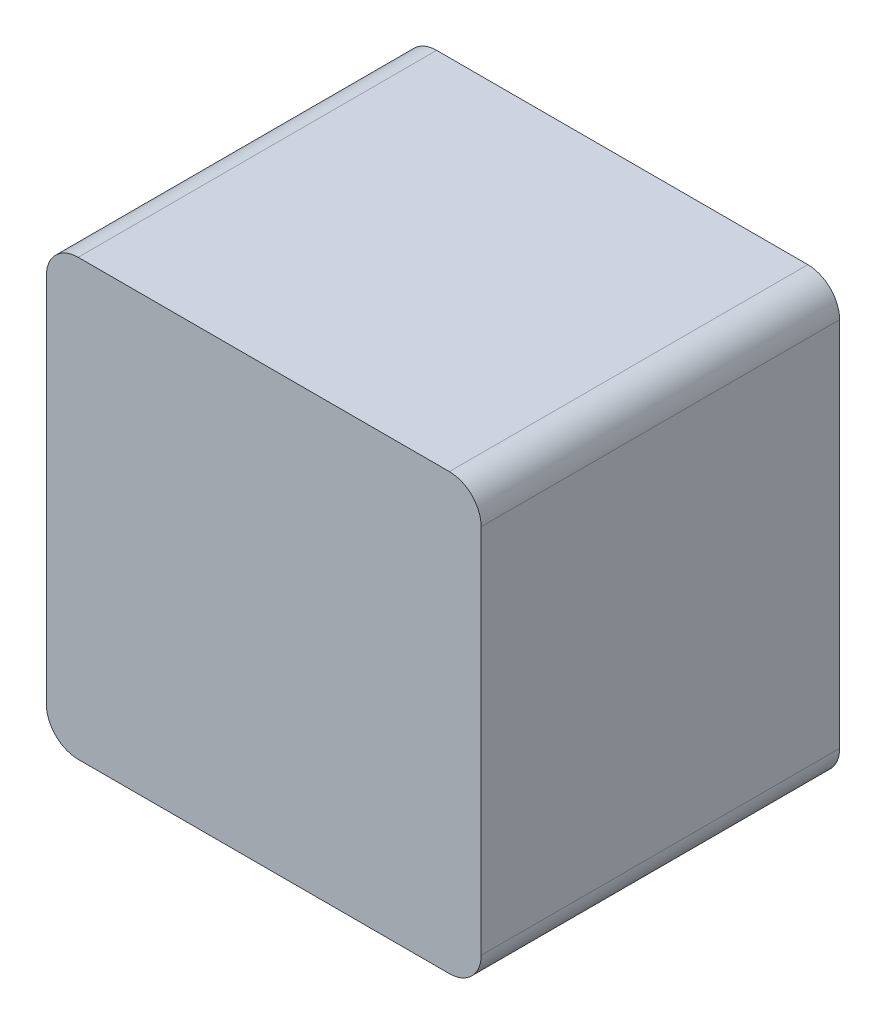
ISO-10303-21;
HEADER;
FILE_DESCRIPTION(('STEP AP214'),'2;1');
FILE_NAME('part.step','',(''),(''),'','','');
FILE_SCHEMA(('AUTOMOTIVE_DESIGN { 1 0 10303 214 1 1 1 1 }'));
ENDSEC;
DATA;
#1=APPLICATION_CONTEXT('core data for automotive mechanical design processes');
#2=APPLICATION_PROTOCOL_DEFINITION('international standard','automotive_design',2000,#1);
#3=PRODUCT_CONTEXT('',#1,'mechanical');
#4=PRODUCT('Part','Part','',(#3));
#5=PRODUCT_RELATED_PRODUCT_CATEGORY('part','',(#4));
#6=PRODUCT_DEFINITION_FORMATION('','',#4);
#7=PRODUCT_DEFINITION_CONTEXT('part definition',#1,'design');
#8=PRODUCT_DEFINITION('design','',#6,#7);
#9=PRODUCT_DEFINITION_SHAPE('','',#8);
#10=(LENGTH_UNIT() NAMED_UNIT(*) SI_UNIT(.MILLI.,.METRE.));
#11=(NAMED_UNIT(*) PLANE_ANGLE_UNIT() SI_UNIT($,.RADIAN.));
#12=(NAMED_UNIT(*) SI_UNIT($,.STERADIAN.) SOLID_ANGLE_UNIT());
#13=UNCERTAINTY_MEASURE_WITH_UNIT(LENGTH_MEASURE(1.E-05),#10,'distance_accuracy_value','');
#14=(GEOMETRIC_REPRESENTATION_CONTEXT(3) GLOBAL_UNCERTAINTY_ASSIGNED_CONTEXT((#13)) GLOBAL_UNIT_ASSIGNED_CONTEXT((#10,
#11,#12)) REPRESENTATION_CONTEXT('',''));
#15=CARTESIAN_POINT('',(0.,0.,0.));
#16=DIRECTION('',(0.,0.,1.));
#17=DIRECTION('',(1.,0.,0.));
#18=AXIS2_PLACEMENT_3D('',#15,#16,#17);
#19=CARTESIAN_POINT('',(54.5,-202.5,-15.));
#20=DIRECTION('',(0.,0.,-1.));
#21=DIRECTION('',(-1.,0.,0.));
#22=AXIS2_PLACEMENT_3D('',#19,#20,#21);
#23=PLANE('',#22);
#24=CARTESIAN_POINT('',(54.5,-202.5,-15.));
#25=DIRECTION('',(0.,0.,-1.));
#26=DIRECTION('',(-1.,0.,0.));
#27=AXIS2_PLACEMENT_3D('',#24,#25,#26);
#28=CIRCLE('',#27,5.);
#29=CARTESIAN_POINT('',(49.5,-202.5,-15.));
#30=VERTEX_POINT('',#29);
#31=EDGE_CURVE('E11',#30,#30,#28,.T.);
#32=ORIENTED_EDGE('',*,*,#31,.T.);
#33=EDGE_LOOP('',(#32));
#34=FACE_BOUND('',#33,.T.);
#35=CARTESIAN_POINT('',(54.5,-202.5,-15.));
#36=DIRECTION('',(0.,0.,-1.));
#37=DIRECTION('',(-1.,0.,0.));
#38=AXIS2_PLACEMENT_3D('',#35,#36,#37);
#39=CIRCLE('',#38,4.9);
#40=CARTESIAN_POINT('',(49.6,-202.5,-15.));
#41=VERTEX_POINT('',#40);
#42=EDGE_CURVE('E53',#41,#41,#39,.T.);
#43=ORIENTED_EDGE('',*,*,#42,.F.);
#44=EDGE_LOOP('',(#43));
#45=FACE_BOUND('',#44,.T.);
#46=ADVANCED_FACE('F42',(#34,#45),#23,.T.);
#47=CARTESIAN_POINT('',(54.5,-202.5,0.));
#48=DIRECTION('',(0.,0.,-1.));
#49=DIRECTION('',(-1.,0.,0.));
#50=AXIS2_PLACEMENT_3D('',#47,#48,#49);
#51=PLANE('',#50);
#52=CARTESIAN_POINT('',(54.5,-202.5,0.));
#53=DIRECTION('',(0.,0.,-1.));
#54=DIRECTION('',(-1.,0.,0.));
#55=AXIS2_PLACEMENT_3D('',#52,#53,#54);
#56=CIRCLE('',#55,5.);
#57=CARTESIAN_POINT('',(49.5,-202.5,0.));
#58=VERTEX_POINT('',#57);
#59=EDGE_CURVE('E46',#58,#58,#56,.T.);
#60=ORIENTED_EDGE('',*,*,#59,.F.);
#61=EDGE_LOOP('',(#60));
#62=FACE_BOUND('',#61,.T.);
#63=CARTESIAN_POINT('',(54.5,-202.5,0.));
#64=DIRECTION('',(0.,0.,-1.));
#65=DIRECTION('',(-1.,0.,0.));
#66=AXIS2_PLACEMENT_3D('',#63,#64,#65);
#67=CIRCLE('',#66,4.9);
#68=CARTESIAN_POINT('',(49.6,-202.5,0.));
#69=VERTEX_POINT('',#68);
#70=EDGE_CURVE('E55',#69,#69,#67,.T.);
#71=ORIENTED_EDGE('',*,*,#70,.T.);
#72=EDGE_LOOP('',(#71));
#73=FACE_BOUND('',#72,.T.);
#74=ADVANCED_FACE('F65',(#62,#73),#51,.F.);
#75=CARTESIAN_POINT('',(54.5,-202.5,-15.));
#76=DIRECTION('',(0.,0.,1.));
#77=DIRECTION('',(1.,0.,0.));
#78=AXIS2_PLACEMENT_3D('',#75,#76,#77);
#79=CYLINDRICAL_SURFACE('',#78,5.);
#80=ORIENTED_EDGE('',*,*,#31,.F.);
#81=EDGE_LOOP('',(#80));
#82=FACE_BOUND('',#81,.T.);
#83=ORIENTED_EDGE('',*,*,#59,.T.);
#84=EDGE_LOOP('',(#83));
#85=FACE_BOUND('',#84,.T.);
#86=ADVANCED_FACE('F44',(#82,#85),#79,.T.);
#87=CARTESIAN_POINT('',(54.5,-202.5,-15.));
#88=DIRECTION('',(0.,0.,1.));
#89=DIRECTION('',(1.,0.,0.));
#90=AXIS2_PLACEMENT_3D('',#87,#88,#89);
#91=CYLINDRICAL_SURFACE('',#90,4.9);
#92=ORIENTED_EDGE('',*,*,#42,.T.);
#93=EDGE_LOOP('',(#92));
#94=FACE_BOUND('',#93,.T.);
#95=ORIENTED_EDGE('',*,*,#70,.F.);
#96=EDGE_LOOP('',(#95));
#97=FACE_BOUND('',#96,.T.);
#98=ADVANCED_FACE('F61',(#94,#97),#91,.F.);
#99=CLOSED_SHELL('',(#46,#74,#86,#98));
#100=MANIFOLD_SOLID_BREP('B2',#99);
#101=CARTESIAN_POINT('',(34.,-223.,33.8));
#102=DIRECTION('',(0.,1.,0.));
#103=DIRECTION('',(0.,0.,1.));
#104=AXIS2_PLACEMENT_3D('',#101,#102,#103);
#105=PLANE('',#104);
#106=DIRECTION('',(1.,0.,0.));
#107=VECTOR('',#106,1.);
#108=CARTESIAN_POINT('',(34.,-223.,0.));
#109=LINE('',#108,#107);
#110=CARTESIAN_POINT('',(37.,-223.,0.));
#111=VERTEX_POINT('',#110);
#112=CARTESIAN_POINT('',(72.,-223.,0.));
#113=VERTEX_POINT('',#112);
#114=EDGE_CURVE('E199',#111,#113,#109,.T.);
#115=ORIENTED_EDGE('',*,*,#114,.T.);
#116=DIRECTION('',(0.,0.,-1.));
#117=VECTOR('',#116,1.);
#118=CARTESIAN_POINT('',(72.,-223.,33.8));
#119=LINE('',#118,#117);
#120=CARTESIAN_POINT('',(72.,-223.,33.8));
#121=VERTEX_POINT('',#120);
#122=EDGE_CURVE('E222',#113,#121,#119,.F.);
#123=ORIENTED_EDGE('',*,*,#122,.T.);
#124=DIRECTION('',(1.,0.,0.));
#125=VECTOR('',#124,1.);
#126=CARTESIAN_POINT('',(34.,-223.,33.8));
#127=LINE('',#126,#125);
#128=CARTESIAN_POINT('',(37.,-223.,33.8));
#129=VERTEX_POINT('',#128);
#130=EDGE_CURVE('E197',#129,#121,#127,.T.);
#131=ORIENTED_EDGE('',*,*,#130,.F.);
#132=DIRECTION('',(0.,0.,-1.));
#133=VECTOR('',#132,1.);
#134=CARTESIAN_POINT('',(37.,-223.,33.8));
#135=LINE('',#134,#133);
#136=EDGE_CURVE('E219',#129,#111,#135,.T.);
#137=ORIENTED_EDGE('',*,*,#136,.T.);
#138=EDGE_LOOP('',(#115,#123,#131,#137));
#139=FACE_BOUND('',#138,.T.);
#140=ADVANCED_FACE('F104',(#139),#105,.F.);
#141=CARTESIAN_POINT('',(75.,-223.,33.8));
#142=DIRECTION('',(-1.,0.,0.));
#143=DIRECTION('',(0.,0.,1.));
#144=AXIS2_PLACEMENT_3D('',#141,#142,#143);
#145=PLANE('',#144);
#146=DIRECTION('',(0.,1.,0.));
#147=VECTOR('',#146,1.);
#148=CARTESIAN_POINT('',(75.,-223.,0.));
#149=LINE('',#148,#147);
#150=CARTESIAN_POINT('',(75.,-220.,0.));
#151=VERTEX_POINT('',#150);
#152=CARTESIAN_POINT('',(75.,-185.,0.));
#153=VERTEX_POINT('',#152);
#154=EDGE_CURVE('E195',#151,#153,#149,.T.);
#155=ORIENTED_EDGE('',*,*,#154,.T.);
#156=DIRECTION('',(0.,0.,-1.));
#157=VECTOR('',#156,1.);
#158=CARTESIAN_POINT('',(75.,-185.,33.8));
#159=LINE('',#158,#157);
#160=CARTESIAN_POINT('',(75.,-185.,33.8));
#161=VERTEX_POINT('',#160);
#162=EDGE_CURVE('E174',#153,#161,#159,.F.);
#163=ORIENTED_EDGE('',*,*,#162,.T.);
#164=DIRECTION('',(0.,1.,0.));
#165=VECTOR('',#164,1.);
#166=CARTESIAN_POINT('',(75.,-223.,33.8));
#167=LINE('',#166,#165);
#168=CARTESIAN_POINT('',(75.,-220.,33.8));
#169=VERTEX_POINT('',#168);
#170=EDGE_CURVE('E238',#169,#161,#167,.T.);
#171=ORIENTED_EDGE('',*,*,#170,.F.);
#172=DIRECTION('',(0.,0.,-1.));
#173=VECTOR('',#172,1.);
#174=CARTESIAN_POINT('',(75.,-220.,33.8));
#175=LINE('',#174,#173);
#176=EDGE_CURVE('E179',#169,#151,#175,.T.);
#177=ORIENTED_EDGE('',*,*,#176,.T.);
#178=EDGE_LOOP('',(#155,#163,#171,#177));
#179=FACE_BOUND('',#178,.T.);
#180=ADVANCED_FACE('F255',(#179),#145,.F.);
#181=CARTESIAN_POINT('',(75.,-182.,33.8));
#182=DIRECTION('',(0.,-1.,0.));
#183=DIRECTION('',(0.,0.,-1.));
#184=AXIS2_PLACEMENT_3D('',#181,#182,#183);
#185=PLANE('',#184);
#186=DIRECTION('',(-1.,0.,0.));
#187=VECTOR('',#186,1.);
#188=CARTESIAN_POINT('',(75.,-182.,33.8));
#189=LINE('',#188,#187);
#190=CARTESIAN_POINT('',(72.,-182.,33.8));
#191=VERTEX_POINT('',#190);
#192=CARTESIAN_POINT('',(37.,-182.,33.8));
#193=VERTEX_POINT('',#192);
#194=EDGE_CURVE('E188',#191,#193,#189,.T.);
#195=ORIENTED_EDGE('',*,*,#194,.F.);
#196=DIRECTION('',(0.,0.,-1.));
#197=VECTOR('',#196,1.);
#198=CARTESIAN_POINT('',(72.,-182.,33.8));
#199=LINE('',#198,#197);
#200=CARTESIAN_POINT('',(72.,-182.,0.));
#201=VERTEX_POINT('',#200);
#202=EDGE_CURVE('E173',#191,#201,#199,.T.);
#203=ORIENTED_EDGE('',*,*,#202,.T.);
#204=DIRECTION('',(-1.,0.,0.));
#205=VECTOR('',#204,1.);
#206=CARTESIAN_POINT('',(75.,-182.,0.));
#207=LINE('',#206,#205);
#208=CARTESIAN_POINT('',(37.,-182.,0.));
#209=VERTEX_POINT('',#208);
#210=EDGE_CURVE('E186',#201,#209,#207,.T.);
#211=ORIENTED_EDGE('',*,*,#210,.T.);
#212=DIRECTION('',(0.,0.,-1.));
#213=VECTOR('',#212,1.);
#214=CARTESIAN_POINT('',(37.,-182.,33.8));
#215=LINE('',#214,#213);
#216=EDGE_CURVE('E190',#209,#193,#215,.F.);
#217=ORIENTED_EDGE('',*,*,#216,.T.);
#218=EDGE_LOOP('',(#195,#203,#211,#217));
#219=FACE_BOUND('',#218,.T.);
#220=ADVANCED_FACE('F185',(#219),#185,.F.);
#221=CARTESIAN_POINT('',(34.,-182.,33.8));
#222=DIRECTION('',(1.,0.,0.));
#223=DIRECTION('',(0.,0.,-1.));
#224=AXIS2_PLACEMENT_3D('',#221,#222,#223);
#225=PLANE('',#224);
#226=DIRECTION('',(0.,-1.,0.));
#227=VECTOR('',#226,1.);
#228=CARTESIAN_POINT('',(34.,-182.,0.));
#229=LINE('',#228,#227);
#230=CARTESIAN_POINT('',(34.,-185.,0.));
#231=VERTEX_POINT('',#230);
#232=CARTESIAN_POINT('',(34.,-220.,0.));
#233=VERTEX_POINT('',#232);
#234=EDGE_CURVE('E194',#231,#233,#229,.T.);
#235=ORIENTED_EDGE('',*,*,#234,.T.);
#236=DIRECTION('',(0.,0.,-1.));
#237=VECTOR('',#236,1.);
#238=CARTESIAN_POINT('',(34.,-220.,33.8));
#239=LINE('',#238,#237);
#240=CARTESIAN_POINT('',(34.,-220.,33.8));
#241=VERTEX_POINT('',#240);
#242=EDGE_CURVE('E40',#233,#241,#239,.F.);
#243=ORIENTED_EDGE('',*,*,#242,.T.);
#244=DIRECTION('',(0.,-1.,0.));
#245=VECTOR('',#244,1.);
#246=CARTESIAN_POINT('',(34.,-182.,33.8));
#247=LINE('',#246,#245);
#248=CARTESIAN_POINT('',(34.,-185.,33.8));
#249=VERTEX_POINT('',#248);
#250=EDGE_CURVE('E203',#249,#241,#247,.T.);
#251=ORIENTED_EDGE('',*,*,#250,.F.);
#252=DIRECTION('',(0.,0.,-1.));
#253=VECTOR('',#252,1.);
#254=CARTESIAN_POINT('',(34.,-185.,33.8));
#255=LINE('',#254,#253);
#256=EDGE_CURVE('E112',#249,#231,#255,.T.);
#257=ORIENTED_EDGE('',*,*,#256,.T.);
#258=EDGE_LOOP('',(#235,#243,#251,#257));
#259=FACE_BOUND('',#258,.T.);
#260=ADVANCED_FACE('F225',(#259),#225,.F.);
#261=CARTESIAN_POINT('',(0.,0.,33.8));
#262=DIRECTION('',(0.,0.,1.));
#263=DIRECTION('',(1.,0.,0.));
#264=AXIS2_PLACEMENT_3D('',#261,#262,#263);
#265=PLANE('',#264);
#266=ORIENTED_EDGE('',*,*,#170,.T.);
#267=CARTESIAN_POINT('',(72.,-185.,33.8));
#268=DIRECTION('',(0.,0.,1.));
#269=DIRECTION('',(1.,0.,0.));
#270=AXIS2_PLACEMENT_3D('',#267,#268,#269);
#271=CIRCLE('',#270,3.);
#272=EDGE_CURVE('E217',#161,#191,#271,.T.);
#273=ORIENTED_EDGE('',*,*,#272,.T.);
#274=ORIENTED_EDGE('',*,*,#194,.T.);
#275=CARTESIAN_POINT('',(37.,-185.,33.8));
#276=DIRECTION('',(0.,0.,1.));
#277=DIRECTION('',(1.,0.,0.));
#278=AXIS2_PLACEMENT_3D('',#275,#276,#277);
#279=CIRCLE('',#278,3.);
#280=EDGE_CURVE('E124',#193,#249,#279,.T.);
#281=ORIENTED_EDGE('',*,*,#280,.T.);
#282=ORIENTED_EDGE('',*,*,#250,.T.);
#283=CARTESIAN_POINT('',(37.,-220.,33.8));
#284=DIRECTION('',(0.,0.,1.));
#285=DIRECTION('',(1.,0.,0.));
#286=AXIS2_PLACEMENT_3D('',#283,#284,#285);
#287=CIRCLE('',#286,3.);
#288=EDGE_CURVE('E213',#241,#129,#287,.T.);
#289=ORIENTED_EDGE('',*,*,#288,.T.);
#290=ORIENTED_EDGE('',*,*,#130,.T.);
#291=CARTESIAN_POINT('',(72.,-220.,33.8));
#292=DIRECTION('',(0.,0.,1.));
#293=DIRECTION('',(1.,0.,0.));
#294=AXIS2_PLACEMENT_3D('',#291,#292,#293);
#295=CIRCLE('',#294,3.);
#296=EDGE_CURVE('E215',#121,#169,#295,.T.);
#297=ORIENTED_EDGE('',*,*,#296,.T.);
#298=EDGE_LOOP('',(#266,#273,#274,#281,#282,#289,#290,#297));
#299=FACE_BOUND('',#298,.T.);
#300=ADVANCED_FACE('F244',(#299),#265,.T.);
#301=CARTESIAN_POINT('',(0.,0.,0.));
#302=DIRECTION('',(0.,0.,1.));
#303=DIRECTION('',(1.,0.,0.));
#304=AXIS2_PLACEMENT_3D('',#301,#302,#303);
#305=PLANE('',#304);
#306=ORIENTED_EDGE('',*,*,#210,.F.);
#307=CARTESIAN_POINT('',(72.,-185.,0.));
#308=DIRECTION('',(0.,0.,1.));
#309=DIRECTION('',(1.,0.,0.));
#310=AXIS2_PLACEMENT_3D('',#307,#308,#309);
#311=CIRCLE('',#310,3.);
#312=EDGE_CURVE('E169',#201,#153,#311,.F.);
#313=ORIENTED_EDGE('',*,*,#312,.T.);
#314=ORIENTED_EDGE('',*,*,#154,.F.);
#315=CARTESIAN_POINT('',(72.,-220.,0.));
#316=DIRECTION('',(0.,0.,1.));
#317=DIRECTION('',(1.,0.,0.));
#318=AXIS2_PLACEMENT_3D('',#315,#316,#317);
#319=CIRCLE('',#318,3.);
#320=EDGE_CURVE('E180',#151,#113,#319,.F.);
#321=ORIENTED_EDGE('',*,*,#320,.T.);
#322=ORIENTED_EDGE('',*,*,#114,.F.);
#323=CARTESIAN_POINT('',(37.,-220.,0.));
#324=DIRECTION('',(0.,0.,1.));
#325=DIRECTION('',(1.,0.,0.));
#326=AXIS2_PLACEMENT_3D('',#323,#324,#325);
#327=CIRCLE('',#326,3.);
#328=EDGE_CURVE('E206',#111,#233,#327,.F.);
#329=ORIENTED_EDGE('',*,*,#328,.T.);
#330=ORIENTED_EDGE('',*,*,#234,.F.);
#331=CARTESIAN_POINT('',(37.,-185.,0.));
#332=DIRECTION('',(0.,0.,1.));
#333=DIRECTION('',(1.,0.,0.));
#334=AXIS2_PLACEMENT_3D('',#331,#332,#333);
#335=CIRCLE('',#334,3.);
#336=EDGE_CURVE('E189',#231,#209,#335,.F.);
#337=ORIENTED_EDGE('',*,*,#336,.T.);
#338=EDGE_LOOP('',(#306,#313,#314,#321,#322,#329,#330,#337));
#339=FACE_BOUND('',#338,.T.);
#340=ADVANCED_FACE('F192',(#339),#305,.F.);
#341=CARTESIAN_POINT('',(72.,-185.,33.8));
#342=DIRECTION('',(0.,0.,-1.));
#343=DIRECTION('',(-1.,0.,0.));
#344=AXIS2_PLACEMENT_3D('',#341,#342,#343);
#345=CYLINDRICAL_SURFACE('',#344,3.);
#346=ORIENTED_EDGE('',*,*,#272,.F.);
#347=ORIENTED_EDGE('',*,*,#162,.F.);
#348=ORIENTED_EDGE('',*,*,#312,.F.);
#349=ORIENTED_EDGE('',*,*,#202,.F.);
#350=EDGE_LOOP('',(#346,#347,#348,#349));
#351=FACE_BOUND('',#350,.T.);
#352=ADVANCED_FACE('F172',(#351),#345,.T.);
#353=CARTESIAN_POINT('',(72.,-220.,33.8));
#354=DIRECTION('',(0.,0.,-1.));
#355=DIRECTION('',(-1.,0.,0.));
#356=AXIS2_PLACEMENT_3D('',#353,#354,#355);
#357=CYLINDRICAL_SURFACE('',#356,3.);
#358=ORIENTED_EDGE('',*,*,#296,.F.);
#359=ORIENTED_EDGE('',*,*,#122,.F.);
#360=ORIENTED_EDGE('',*,*,#320,.F.);
#361=ORIENTED_EDGE('',*,*,#176,.F.);
#362=EDGE_LOOP('',(#358,#359,#360,#361));
#363=FACE_BOUND('',#362,.T.);
#364=ADVANCED_FACE('F266',(#363),#357,.T.);
#365=CARTESIAN_POINT('',(37.,-220.,33.8));
#366=DIRECTION('',(0.,0.,-1.));
#367=DIRECTION('',(-1.,0.,0.));
#368=AXIS2_PLACEMENT_3D('',#365,#366,#367);
#369=CYLINDRICAL_SURFACE('',#368,3.);
#370=ORIENTED_EDGE('',*,*,#288,.F.);
#371=ORIENTED_EDGE('',*,*,#242,.F.);
#372=ORIENTED_EDGE('',*,*,#328,.F.);
#373=ORIENTED_EDGE('',*,*,#136,.F.);
#374=EDGE_LOOP('',(#370,#371,#372,#373));
#375=FACE_BOUND('',#374,.T.);
#376=ADVANCED_FACE('F232',(#375),#369,.T.);
#377=CARTESIAN_POINT('',(37.,-185.,33.8));
#378=DIRECTION('',(0.,0.,-1.));
#379=DIRECTION('',(-1.,0.,0.));
#380=AXIS2_PLACEMENT_3D('',#377,#378,#379);
#381=CYLINDRICAL_SURFACE('',#380,3.);
#382=ORIENTED_EDGE('',*,*,#280,.F.);
#383=ORIENTED_EDGE('',*,*,#216,.F.);
#384=ORIENTED_EDGE('',*,*,#336,.F.);
#385=ORIENTED_EDGE('',*,*,#256,.F.);
#386=EDGE_LOOP('',(#382,#383,#384,#385));
#387=FACE_BOUND('',#386,.T.);
#388=ADVANCED_FACE('F106',(#387),#381,.T.);
#389=CLOSED_SHELL('',(#140,#180,#220,#260,#300,#340,#352,#364,#376,#388));
#390=MANIFOLD_SOLID_BREP('B6',#389);
#391=ADVANCED_BREP_SHAPE_REPRESENTATION('',(#18,#100,#390),#14);
#392=SHAPE_DEFINITION_REPRESENTATION(#9,#391);
ENDSEC;
END-ISO-10303-21;
